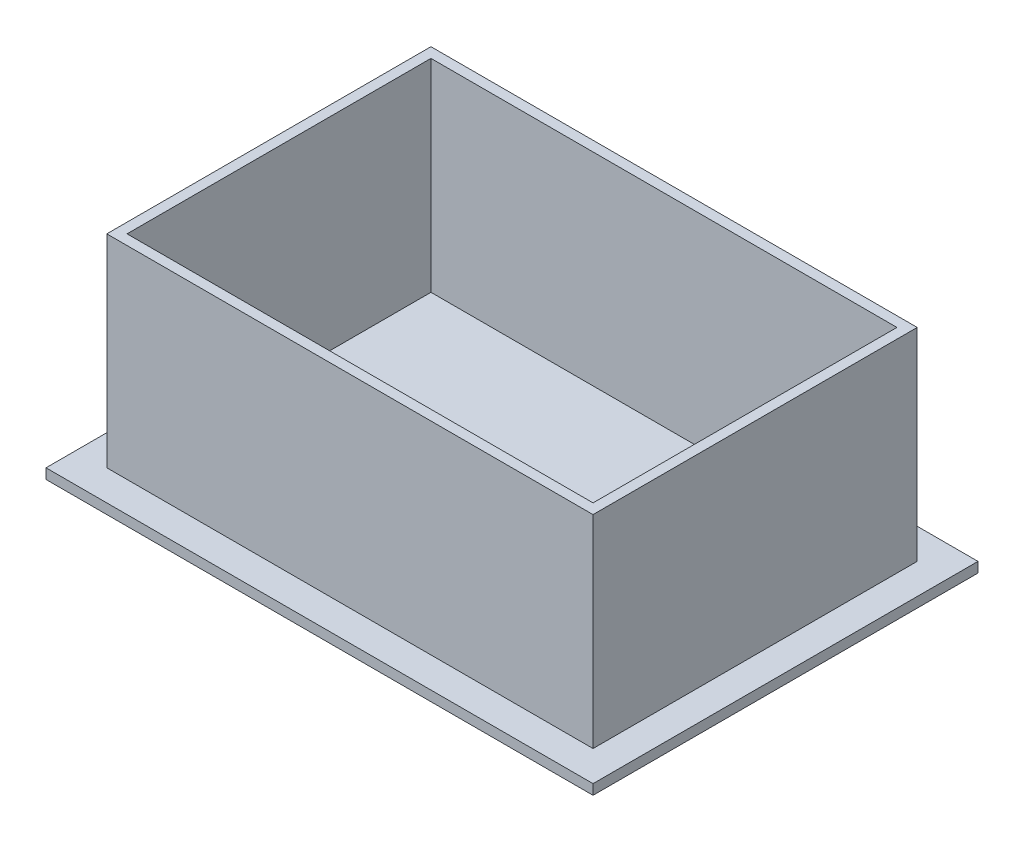
ISO-10303-21;
HEADER;
FILE_DESCRIPTION(('STEP AP214'),'2;1');
FILE_NAME('part.step','',(''),(''),'','','');
FILE_SCHEMA(('AUTOMOTIVE_DESIGN { 1 0 10303 214 1 1 1 1 }'));
ENDSEC;
DATA;
#1=APPLICATION_CONTEXT('core data for automotive mechanical design processes');
#2=APPLICATION_PROTOCOL_DEFINITION('international standard','automotive_design',2000,#1);
#3=PRODUCT_CONTEXT('',#1,'mechanical');
#4=PRODUCT('Part','Part','',(#3));
#5=PRODUCT_RELATED_PRODUCT_CATEGORY('part','',(#4));
#6=PRODUCT_DEFINITION_FORMATION('','',#4);
#7=PRODUCT_DEFINITION_CONTEXT('part definition',#1,'design');
#8=PRODUCT_DEFINITION('design','',#6,#7);
#9=PRODUCT_DEFINITION_SHAPE('','',#8);
#10=(LENGTH_UNIT() NAMED_UNIT(*) SI_UNIT(.MILLI.,.METRE.));
#11=(NAMED_UNIT(*) PLANE_ANGLE_UNIT() SI_UNIT($,.RADIAN.));
#12=(NAMED_UNIT(*) SI_UNIT($,.STERADIAN.) SOLID_ANGLE_UNIT());
#13=UNCERTAINTY_MEASURE_WITH_UNIT(LENGTH_MEASURE(1.E-05),#10,'distance_accuracy_value','');
#14=(GEOMETRIC_REPRESENTATION_CONTEXT(3) GLOBAL_UNCERTAINTY_ASSIGNED_CONTEXT((#13)) GLOBAL_UNIT_ASSIGNED_CONTEXT((#10,
#11,#12)) REPRESENTATION_CONTEXT('',''));
#15=CARTESIAN_POINT('',(0.,0.,0.));
#16=DIRECTION('',(0.,0.,1.));
#17=DIRECTION('',(1.,0.,0.));
#18=AXIS2_PLACEMENT_3D('',#15,#16,#17);
#19=CARTESIAN_POINT('',(85.725,3.175,-60.325));
#20=DIRECTION('',(0.,-1.,0.));
#21=DIRECTION('',(0.,0.,-1.));
#22=AXIS2_PLACEMENT_3D('',#19,#20,#21);
#23=PLANE('',#22);
#24=DIRECTION('',(0.,0.,-1.));
#25=VECTOR('',#24,1.);
#26=CARTESIAN_POINT('',(85.725,3.175,60.325));
#27=LINE('',#26,#25);
#28=CARTESIAN_POINT('',(85.725,3.175,60.325));
#29=VERTEX_POINT('',#28);
#30=CARTESIAN_POINT('',(85.725,3.175,-60.325));
#31=VERTEX_POINT('',#30);
#32=EDGE_CURVE('E191',#29,#31,#27,.T.);
#33=ORIENTED_EDGE('',*,*,#32,.T.);
#34=DIRECTION('',(-1.,0.,0.));
#35=VECTOR('',#34,1.);
#36=CARTESIAN_POINT('',(-85.725,3.175,-60.325));
#37=LINE('',#36,#35);
#38=CARTESIAN_POINT('',(-85.725,3.175,-60.325));
#39=VERTEX_POINT('',#38);
#40=EDGE_CURVE('E194',#31,#39,#37,.T.);
#41=ORIENTED_EDGE('',*,*,#40,.T.);
#42=DIRECTION('',(0.,0.,1.));
#43=VECTOR('',#42,1.);
#44=CARTESIAN_POINT('',(-85.725,3.175,60.325));
#45=LINE('',#44,#43);
#46=CARTESIAN_POINT('',(-85.725,3.175,60.325));
#47=VERTEX_POINT('',#46);
#48=EDGE_CURVE('E197',#39,#47,#45,.T.);
#49=ORIENTED_EDGE('',*,*,#48,.T.);
#50=DIRECTION('',(1.,0.,0.));
#51=VECTOR('',#50,1.);
#52=CARTESIAN_POINT('',(-85.725,3.175,60.325));
#53=LINE('',#52,#51);
#54=EDGE_CURVE('E199',#47,#29,#53,.T.);
#55=ORIENTED_EDGE('',*,*,#54,.T.);
#56=EDGE_LOOP('',(#33,#41,#49,#55));
#57=FACE_BOUND('',#56,.T.);
#58=DIRECTION('',(0.,0.,1.));
#59=VECTOR('',#58,1.);
#60=CARTESIAN_POINT('',(-76.2,3.175,50.8));
#61=LINE('',#60,#59);
#62=CARTESIAN_POINT('',(-76.2,3.175,-50.8));
#63=VERTEX_POINT('',#62);
#64=CARTESIAN_POINT('',(-76.2,3.175,50.8));
#65=VERTEX_POINT('',#64);
#66=EDGE_CURVE('E139',#63,#65,#61,.T.);
#67=ORIENTED_EDGE('',*,*,#66,.F.);
#68=DIRECTION('',(-1.,0.,0.));
#69=VECTOR('',#68,1.);
#70=CARTESIAN_POINT('',(-76.2,3.175,-50.8));
#71=LINE('',#70,#69);
#72=CARTESIAN_POINT('',(76.2,3.175,-50.8));
#73=VERTEX_POINT('',#72);
#74=EDGE_CURVE('E167',#73,#63,#71,.T.);
#75=ORIENTED_EDGE('',*,*,#74,.F.);
#76=DIRECTION('',(0.,0.,-1.));
#77=VECTOR('',#76,1.);
#78=CARTESIAN_POINT('',(76.2,3.175,50.8));
#79=LINE('',#78,#77);
#80=CARTESIAN_POINT('',(76.2,3.175,50.8));
#81=VERTEX_POINT('',#80);
#82=EDGE_CURVE('E53',#81,#73,#79,.T.);
#83=ORIENTED_EDGE('',*,*,#82,.F.);
#84=DIRECTION('',(1.,0.,0.));
#85=VECTOR('',#84,1.);
#86=CARTESIAN_POINT('',(-76.2,3.175,50.8));
#87=LINE('',#86,#85);
#88=EDGE_CURVE('E48',#65,#81,#87,.T.);
#89=ORIENTED_EDGE('',*,*,#88,.F.);
#90=EDGE_LOOP('',(#67,#75,#83,#89));
#91=FACE_BOUND('',#90,.T.);
#92=ADVANCED_FACE('F33',(#57,#91),#23,.F.);
#93=CARTESIAN_POINT('',(85.725,3.175,60.325));
#94=DIRECTION('',(-1.,0.,0.));
#95=DIRECTION('',(0.,0.,1.));
#96=AXIS2_PLACEMENT_3D('',#93,#94,#95);
#97=PLANE('',#96);
#98=DIRECTION('',(0.,0.,-1.));
#99=VECTOR('',#98,1.);
#100=CARTESIAN_POINT('',(85.725,0.,60.325));
#101=LINE('',#100,#99);
#102=CARTESIAN_POINT('',(85.725,0.,60.325));
#103=VERTEX_POINT('',#102);
#104=CARTESIAN_POINT('',(85.725,0.,-60.325));
#105=VERTEX_POINT('',#104);
#106=EDGE_CURVE('E190',#103,#105,#101,.T.);
#107=ORIENTED_EDGE('',*,*,#106,.T.);
#108=DIRECTION('',(0.,-1.,0.));
#109=VECTOR('',#108,1.);
#110=CARTESIAN_POINT('',(85.725,3.175,-60.325));
#111=LINE('',#110,#109);
#112=EDGE_CURVE('E11',#31,#105,#111,.T.);
#113=ORIENTED_EDGE('',*,*,#112,.F.);
#114=ORIENTED_EDGE('',*,*,#32,.F.);
#115=DIRECTION('',(0.,-1.,0.));
#116=VECTOR('',#115,1.);
#117=CARTESIAN_POINT('',(85.725,3.175,60.325));
#118=LINE('',#117,#116);
#119=EDGE_CURVE('E201',#29,#103,#118,.T.);
#120=ORIENTED_EDGE('',*,*,#119,.T.);
#121=EDGE_LOOP('',(#107,#113,#114,#120));
#122=FACE_BOUND('',#121,.T.);
#123=ADVANCED_FACE('F35',(#122),#97,.F.);
#124=CARTESIAN_POINT('',(-85.725,3.175,-60.325));
#125=DIRECTION('',(0.,0.,1.));
#126=DIRECTION('',(1.,0.,0.));
#127=AXIS2_PLACEMENT_3D('',#124,#125,#126);
#128=PLANE('',#127);
#129=DIRECTION('',(-1.,0.,0.));
#130=VECTOR('',#129,1.);
#131=CARTESIAN_POINT('',(-85.725,0.,-60.325));
#132=LINE('',#131,#130);
#133=CARTESIAN_POINT('',(-85.725,0.,-60.325));
#134=VERTEX_POINT('',#133);
#135=EDGE_CURVE('E204',#105,#134,#132,.T.);
#136=ORIENTED_EDGE('',*,*,#135,.T.);
#137=DIRECTION('',(0.,-1.,0.));
#138=VECTOR('',#137,1.);
#139=CARTESIAN_POINT('',(-85.725,3.175,-60.325));
#140=LINE('',#139,#138);
#141=EDGE_CURVE('E41',#39,#134,#140,.T.);
#142=ORIENTED_EDGE('',*,*,#141,.F.);
#143=ORIENTED_EDGE('',*,*,#40,.F.);
#144=ORIENTED_EDGE('',*,*,#112,.T.);
#145=EDGE_LOOP('',(#136,#142,#143,#144));
#146=FACE_BOUND('',#145,.T.);
#147=ADVANCED_FACE('F233',(#146),#128,.F.);
#148=CARTESIAN_POINT('',(-85.725,3.175,60.325));
#149=DIRECTION('',(1.,0.,0.));
#150=DIRECTION('',(0.,0.,-1.));
#151=AXIS2_PLACEMENT_3D('',#148,#149,#150);
#152=PLANE('',#151);
#153=DIRECTION('',(0.,0.,1.));
#154=VECTOR('',#153,1.);
#155=CARTESIAN_POINT('',(-85.725,0.,60.325));
#156=LINE('',#155,#154);
#157=CARTESIAN_POINT('',(-85.725,0.,60.325));
#158=VERTEX_POINT('',#157);
#159=EDGE_CURVE('E206',#134,#158,#156,.T.);
#160=ORIENTED_EDGE('',*,*,#159,.T.);
#161=DIRECTION('',(0.,-1.,0.));
#162=VECTOR('',#161,1.);
#163=CARTESIAN_POINT('',(-85.725,3.175,60.325));
#164=LINE('',#163,#162);
#165=EDGE_CURVE('E211',#47,#158,#164,.T.);
#166=ORIENTED_EDGE('',*,*,#165,.F.);
#167=ORIENTED_EDGE('',*,*,#48,.F.);
#168=ORIENTED_EDGE('',*,*,#141,.T.);
#169=EDGE_LOOP('',(#160,#166,#167,#168));
#170=FACE_BOUND('',#169,.T.);
#171=ADVANCED_FACE('F218',(#170),#152,.F.);
#172=CARTESIAN_POINT('',(-85.725,3.175,60.325));
#173=DIRECTION('',(0.,0.,-1.));
#174=DIRECTION('',(-1.,0.,0.));
#175=AXIS2_PLACEMENT_3D('',#172,#173,#174);
#176=PLANE('',#175);
#177=DIRECTION('',(1.,0.,0.));
#178=VECTOR('',#177,1.);
#179=CARTESIAN_POINT('',(-85.725,0.,60.325));
#180=LINE('',#179,#178);
#181=EDGE_CURVE('E195',#158,#103,#180,.T.);
#182=ORIENTED_EDGE('',*,*,#181,.T.);
#183=ORIENTED_EDGE('',*,*,#119,.F.);
#184=ORIENTED_EDGE('',*,*,#54,.F.);
#185=ORIENTED_EDGE('',*,*,#165,.T.);
#186=EDGE_LOOP('',(#182,#183,#184,#185));
#187=FACE_BOUND('',#186,.T.);
#188=ADVANCED_FACE('F227',(#187),#176,.F.);
#189=CARTESIAN_POINT('',(85.725,0.,-60.325));
#190=DIRECTION('',(0.,-1.,0.));
#191=DIRECTION('',(0.,0.,-1.));
#192=AXIS2_PLACEMENT_3D('',#189,#190,#191);
#193=PLANE('',#192);
#194=ORIENTED_EDGE('',*,*,#106,.F.);
#195=ORIENTED_EDGE('',*,*,#181,.F.);
#196=ORIENTED_EDGE('',*,*,#159,.F.);
#197=ORIENTED_EDGE('',*,*,#135,.F.);
#198=EDGE_LOOP('',(#194,#195,#196,#197));
#199=FACE_BOUND('',#198,.T.);
#200=ADVANCED_FACE('F224',(#199),#193,.T.);
#201=CARTESIAN_POINT('',(-76.2,66.675,-50.8));
#202=DIRECTION('',(0.,-1.,0.));
#203=DIRECTION('',(0.,0.,-1.));
#204=AXIS2_PLACEMENT_3D('',#201,#202,#203);
#205=PLANE('',#204);
#206=DIRECTION('',(0.,0.,1.));
#207=VECTOR('',#206,1.);
#208=CARTESIAN_POINT('',(-76.2,66.675,50.8));
#209=LINE('',#208,#207);
#210=CARTESIAN_POINT('',(-76.2,66.675,-50.8));
#211=VERTEX_POINT('',#210);
#212=CARTESIAN_POINT('',(-76.2,66.675,50.8));
#213=VERTEX_POINT('',#212);
#214=EDGE_CURVE('E163',#211,#213,#209,.T.);
#215=ORIENTED_EDGE('',*,*,#214,.T.);
#216=DIRECTION('',(1.,0.,0.));
#217=VECTOR('',#216,1.);
#218=CARTESIAN_POINT('',(-76.2,66.675,50.8));
#219=LINE('',#218,#217);
#220=CARTESIAN_POINT('',(76.2,66.675,50.8));
#221=VERTEX_POINT('',#220);
#222=EDGE_CURVE('E166',#213,#221,#219,.T.);
#223=ORIENTED_EDGE('',*,*,#222,.T.);
#224=DIRECTION('',(0.,0.,-1.));
#225=VECTOR('',#224,1.);
#226=CARTESIAN_POINT('',(76.2,66.675,50.8));
#227=LINE('',#226,#225);
#228=CARTESIAN_POINT('',(76.2,66.675,-50.8));
#229=VERTEX_POINT('',#228);
#230=EDGE_CURVE('E169',#221,#229,#227,.T.);
#231=ORIENTED_EDGE('',*,*,#230,.T.);
#232=DIRECTION('',(-1.,0.,0.));
#233=VECTOR('',#232,1.);
#234=CARTESIAN_POINT('',(-76.2,66.675,-50.8));
#235=LINE('',#234,#233);
#236=EDGE_CURVE('E171',#229,#211,#235,.T.);
#237=ORIENTED_EDGE('',*,*,#236,.T.);
#238=EDGE_LOOP('',(#215,#223,#231,#237));
#239=FACE_BOUND('',#238,.T.);
#240=DIRECTION('',(0.,0.,-1.));
#241=VECTOR('',#240,1.);
#242=CARTESIAN_POINT('',(73.025,66.675,47.625));
#243=LINE('',#242,#241);
#244=CARTESIAN_POINT('',(73.025,66.675,47.625));
#245=VERTEX_POINT('',#244);
#246=CARTESIAN_POINT('',(73.025,66.675,-47.625));
#247=VERTEX_POINT('',#246);
#248=EDGE_CURVE('E121',#245,#247,#243,.T.);
#249=ORIENTED_EDGE('',*,*,#248,.F.);
#250=DIRECTION('',(1.,0.,0.));
#251=VECTOR('',#250,1.);
#252=CARTESIAN_POINT('',(-73.025,66.675,47.625));
#253=LINE('',#252,#251);
#254=CARTESIAN_POINT('',(-73.025,66.675,47.625));
#255=VERTEX_POINT('',#254);
#256=EDGE_CURVE('E147',#255,#245,#253,.T.);
#257=ORIENTED_EDGE('',*,*,#256,.F.);
#258=DIRECTION('',(0.,0.,1.));
#259=VECTOR('',#258,1.);
#260=CARTESIAN_POINT('',(-73.025,66.675,47.625));
#261=LINE('',#260,#259);
#262=CARTESIAN_POINT('',(-73.025,66.675,-47.625));
#263=VERTEX_POINT('',#262);
#264=EDGE_CURVE('E145',#263,#255,#261,.T.);
#265=ORIENTED_EDGE('',*,*,#264,.F.);
#266=DIRECTION('',(-1.,0.,0.));
#267=VECTOR('',#266,1.);
#268=CARTESIAN_POINT('',(-73.025,66.675,-47.625));
#269=LINE('',#268,#267);
#270=EDGE_CURVE('E131',#247,#263,#269,.T.);
#271=ORIENTED_EDGE('',*,*,#270,.F.);
#272=EDGE_LOOP('',(#249,#257,#265,#271));
#273=FACE_BOUND('',#272,.T.);
#274=ADVANCED_FACE('F143',(#239,#273),#205,.F.);
#275=CARTESIAN_POINT('',(-76.2,66.675,50.8));
#276=DIRECTION('',(1.,0.,0.));
#277=DIRECTION('',(0.,0.,-1.));
#278=AXIS2_PLACEMENT_3D('',#275,#276,#277);
#279=PLANE('',#278);
#280=ORIENTED_EDGE('',*,*,#66,.T.);
#281=DIRECTION('',(0.,-1.,0.));
#282=VECTOR('',#281,1.);
#283=CARTESIAN_POINT('',(-76.2,66.675,50.8));
#284=LINE('',#283,#282);
#285=EDGE_CURVE('E188',#213,#65,#284,.T.);
#286=ORIENTED_EDGE('',*,*,#285,.F.);
#287=ORIENTED_EDGE('',*,*,#214,.F.);
#288=DIRECTION('',(0.,-1.,0.));
#289=VECTOR('',#288,1.);
#290=CARTESIAN_POINT('',(-76.2,66.675,-50.8));
#291=LINE('',#290,#289);
#292=EDGE_CURVE('E173',#211,#63,#291,.T.);
#293=ORIENTED_EDGE('',*,*,#292,.T.);
#294=EDGE_LOOP('',(#280,#286,#287,#293));
#295=FACE_BOUND('',#294,.T.);
#296=ADVANCED_FACE('F271',(#295),#279,.F.);
#297=CARTESIAN_POINT('',(-76.2,66.675,50.8));
#298=DIRECTION('',(0.,0.,-1.));
#299=DIRECTION('',(-1.,0.,0.));
#300=AXIS2_PLACEMENT_3D('',#297,#298,#299);
#301=PLANE('',#300);
#302=ORIENTED_EDGE('',*,*,#88,.T.);
#303=DIRECTION('',(0.,-1.,0.));
#304=VECTOR('',#303,1.);
#305=CARTESIAN_POINT('',(76.2,66.675,50.8));
#306=LINE('',#305,#304);
#307=EDGE_CURVE('E185',#221,#81,#306,.T.);
#308=ORIENTED_EDGE('',*,*,#307,.F.);
#309=ORIENTED_EDGE('',*,*,#222,.F.);
#310=ORIENTED_EDGE('',*,*,#285,.T.);
#311=EDGE_LOOP('',(#302,#308,#309,#310));
#312=FACE_BOUND('',#311,.T.);
#313=ADVANCED_FACE('F279',(#312),#301,.F.);
#314=CARTESIAN_POINT('',(76.2,66.675,50.8));
#315=DIRECTION('',(-1.,0.,0.));
#316=DIRECTION('',(0.,0.,1.));
#317=AXIS2_PLACEMENT_3D('',#314,#315,#316);
#318=PLANE('',#317);
#319=ORIENTED_EDGE('',*,*,#82,.T.);
#320=DIRECTION('',(0.,-1.,0.));
#321=VECTOR('',#320,1.);
#322=CARTESIAN_POINT('',(76.2,66.675,-50.8));
#323=LINE('',#322,#321);
#324=EDGE_CURVE('E182',#229,#73,#323,.T.);
#325=ORIENTED_EDGE('',*,*,#324,.F.);
#326=ORIENTED_EDGE('',*,*,#230,.F.);
#327=ORIENTED_EDGE('',*,*,#307,.T.);
#328=EDGE_LOOP('',(#319,#325,#326,#327));
#329=FACE_BOUND('',#328,.T.);
#330=ADVANCED_FACE('F275',(#329),#318,.F.);
#331=CARTESIAN_POINT('',(-76.2,66.675,-50.8));
#332=DIRECTION('',(0.,0.,1.));
#333=DIRECTION('',(1.,0.,0.));
#334=AXIS2_PLACEMENT_3D('',#331,#332,#333);
#335=PLANE('',#334);
#336=ORIENTED_EDGE('',*,*,#74,.T.);
#337=ORIENTED_EDGE('',*,*,#292,.F.);
#338=ORIENTED_EDGE('',*,*,#236,.F.);
#339=ORIENTED_EDGE('',*,*,#324,.T.);
#340=EDGE_LOOP('',(#336,#337,#338,#339));
#341=FACE_BOUND('',#340,.T.);
#342=ADVANCED_FACE('F268',(#341),#335,.F.);
#343=CARTESIAN_POINT('',(73.025,66.675,47.625));
#344=DIRECTION('',(-1.,0.,0.));
#345=DIRECTION('',(0.,0.,1.));
#346=AXIS2_PLACEMENT_3D('',#343,#344,#345);
#347=PLANE('',#346);
#348=DIRECTION('',(0.,0.,-1.));
#349=VECTOR('',#348,1.);
#350=CARTESIAN_POINT('',(73.025,3.175,47.625));
#351=LINE('',#350,#349);
#352=CARTESIAN_POINT('',(73.025,3.175,47.625));
#353=VERTEX_POINT('',#352);
#354=CARTESIAN_POINT('',(73.025,3.175,-47.625));
#355=VERTEX_POINT('',#354);
#356=EDGE_CURVE('E151',#353,#355,#351,.T.);
#357=ORIENTED_EDGE('',*,*,#356,.F.);
#358=DIRECTION('',(0.,-1.,0.));
#359=VECTOR('',#358,1.);
#360=CARTESIAN_POINT('',(73.025,66.675,47.625));
#361=LINE('',#360,#359);
#362=EDGE_CURVE('E127',#245,#353,#361,.T.);
#363=ORIENTED_EDGE('',*,*,#362,.F.);
#364=ORIENTED_EDGE('',*,*,#248,.T.);
#365=DIRECTION('',(0.,-1.,0.));
#366=VECTOR('',#365,1.);
#367=CARTESIAN_POINT('',(73.025,66.675,-47.625));
#368=LINE('',#367,#366);
#369=EDGE_CURVE('E125',#247,#355,#368,.T.);
#370=ORIENTED_EDGE('',*,*,#369,.T.);
#371=EDGE_LOOP('',(#357,#363,#364,#370));
#372=FACE_BOUND('',#371,.T.);
#373=ADVANCED_FACE('F124',(#372),#347,.T.);
#374=CARTESIAN_POINT('',(-73.025,66.675,-47.625));
#375=DIRECTION('',(0.,0.,1.));
#376=DIRECTION('',(1.,0.,0.));
#377=AXIS2_PLACEMENT_3D('',#374,#375,#376);
#378=PLANE('',#377);
#379=DIRECTION('',(-1.,0.,0.));
#380=VECTOR('',#379,1.);
#381=CARTESIAN_POINT('',(-73.025,3.175,-47.625));
#382=LINE('',#381,#380);
#383=CARTESIAN_POINT('',(-73.025,3.175,-47.625));
#384=VERTEX_POINT('',#383);
#385=EDGE_CURVE('E138',#355,#384,#382,.T.);
#386=ORIENTED_EDGE('',*,*,#385,.F.);
#387=ORIENTED_EDGE('',*,*,#369,.F.);
#388=ORIENTED_EDGE('',*,*,#270,.T.);
#389=DIRECTION('',(0.,-1.,0.));
#390=VECTOR('',#389,1.);
#391=CARTESIAN_POINT('',(-73.025,66.675,-47.625));
#392=LINE('',#391,#390);
#393=EDGE_CURVE('E140',#263,#384,#392,.T.);
#394=ORIENTED_EDGE('',*,*,#393,.T.);
#395=EDGE_LOOP('',(#386,#387,#388,#394));
#396=FACE_BOUND('',#395,.T.);
#397=ADVANCED_FACE('F135',(#396),#378,.T.);
#398=CARTESIAN_POINT('',(-73.025,66.675,47.625));
#399=DIRECTION('',(1.,0.,0.));
#400=DIRECTION('',(0.,0.,-1.));
#401=AXIS2_PLACEMENT_3D('',#398,#399,#400);
#402=PLANE('',#401);
#403=DIRECTION('',(0.,0.,1.));
#404=VECTOR('',#403,1.);
#405=CARTESIAN_POINT('',(-73.025,3.175,47.625));
#406=LINE('',#405,#404);
#407=CARTESIAN_POINT('',(-73.025,3.175,47.625));
#408=VERTEX_POINT('',#407);
#409=EDGE_CURVE('E154',#384,#408,#406,.T.);
#410=ORIENTED_EDGE('',*,*,#409,.F.);
#411=ORIENTED_EDGE('',*,*,#393,.F.);
#412=ORIENTED_EDGE('',*,*,#264,.T.);
#413=DIRECTION('',(0.,-1.,0.));
#414=VECTOR('',#413,1.);
#415=CARTESIAN_POINT('',(-73.025,66.675,47.625));
#416=LINE('',#415,#414);
#417=EDGE_CURVE('E160',#255,#408,#416,.T.);
#418=ORIENTED_EDGE('',*,*,#417,.T.);
#419=EDGE_LOOP('',(#410,#411,#412,#418));
#420=FACE_BOUND('',#419,.T.);
#421=ADVANCED_FACE('F253',(#420),#402,.T.);
#422=CARTESIAN_POINT('',(-73.025,66.675,47.625));
#423=DIRECTION('',(0.,0.,-1.));
#424=DIRECTION('',(-1.,0.,0.));
#425=AXIS2_PLACEMENT_3D('',#422,#423,#424);
#426=PLANE('',#425);
#427=DIRECTION('',(1.,0.,0.));
#428=VECTOR('',#427,1.);
#429=CARTESIAN_POINT('',(-73.025,3.175,47.625));
#430=LINE('',#429,#428);
#431=EDGE_CURVE('E132',#408,#353,#430,.T.);
#432=ORIENTED_EDGE('',*,*,#431,.F.);
#433=ORIENTED_EDGE('',*,*,#417,.F.);
#434=ORIENTED_EDGE('',*,*,#256,.T.);
#435=ORIENTED_EDGE('',*,*,#362,.T.);
#436=EDGE_LOOP('',(#432,#433,#434,#435));
#437=FACE_BOUND('',#436,.T.);
#438=ADVANCED_FACE('F248',(#437),#426,.T.);
#439=ORIENTED_EDGE('',*,*,#431,.T.);
#440=ORIENTED_EDGE('',*,*,#356,.T.);
#441=ORIENTED_EDGE('',*,*,#385,.T.);
#442=ORIENTED_EDGE('',*,*,#409,.T.);
#443=EDGE_LOOP('',(#439,#440,#441,#442));
#444=FACE_BOUND('',#443,.T.);
#445=ADVANCED_FACE('F242',(#444),#23,.F.);
#446=CLOSED_SHELL('',(#92,#123,#147,#171,#188,#200,#274,#296,#313,#330,#342,#373,#397,#421,#438,#445));
#447=MANIFOLD_SOLID_BREP('B2',#446);
#448=ADVANCED_BREP_SHAPE_REPRESENTATION('',(#18,#447),#14);
#449=SHAPE_DEFINITION_REPRESENTATION(#9,#448);
ENDSEC;
END-ISO-10303-21;
